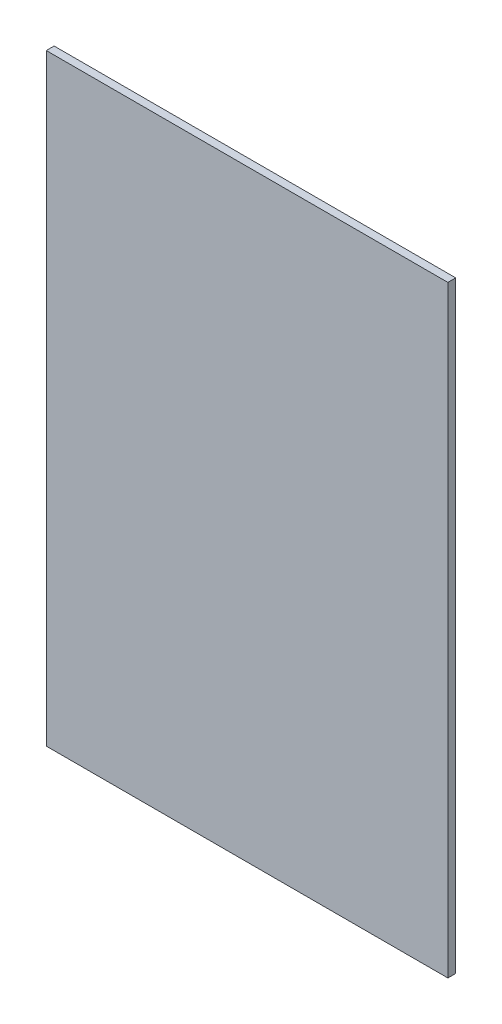
ISO-10303-21;
HEADER;
FILE_DESCRIPTION(('STEP AP214'),'2;1');
FILE_NAME('part.step','',(''),(''),'','','');
FILE_SCHEMA(('AUTOMOTIVE_DESIGN { 1 0 10303 214 1 1 1 1 }'));
ENDSEC;
DATA;
#1=APPLICATION_CONTEXT('core data for automotive mechanical design processes');
#2=APPLICATION_PROTOCOL_DEFINITION('international standard','automotive_design',2000,#1);
#3=PRODUCT_CONTEXT('',#1,'mechanical');
#4=PRODUCT('Part','Part','',(#3));
#5=PRODUCT_RELATED_PRODUCT_CATEGORY('part','',(#4));
#6=PRODUCT_DEFINITION_FORMATION('','',#4);
#7=PRODUCT_DEFINITION_CONTEXT('part definition',#1,'design');
#8=PRODUCT_DEFINITION('design','',#6,#7);
#9=PRODUCT_DEFINITION_SHAPE('','',#8);
#10=(LENGTH_UNIT() NAMED_UNIT(*) SI_UNIT(.MILLI.,.METRE.));
#11=(NAMED_UNIT(*) PLANE_ANGLE_UNIT() SI_UNIT($,.RADIAN.));
#12=(NAMED_UNIT(*) SI_UNIT($,.STERADIAN.) SOLID_ANGLE_UNIT());
#13=UNCERTAINTY_MEASURE_WITH_UNIT(LENGTH_MEASURE(1.E-05),#10,'distance_accuracy_value','');
#14=(GEOMETRIC_REPRESENTATION_CONTEXT(3) GLOBAL_UNCERTAINTY_ASSIGNED_CONTEXT((#13)) GLOBAL_UNIT_ASSIGNED_CONTEXT((#10,
#11,#12)) REPRESENTATION_CONTEXT('',''));
#15=CARTESIAN_POINT('',(0.,0.,0.));
#16=DIRECTION('',(0.,0.,1.));
#17=DIRECTION('',(1.,0.,0.));
#18=AXIS2_PLACEMENT_3D('',#15,#16,#17);
#19=CARTESIAN_POINT('',(304.8,-457.2,11.90625));
#20=DIRECTION('',(-1.,0.,0.));
#21=DIRECTION('',(0.,0.,1.));
#22=AXIS2_PLACEMENT_3D('',#19,#20,#21);
#23=PLANE('',#22);
#24=DIRECTION('',(0.,1.,0.));
#25=VECTOR('',#24,1.);
#26=CARTESIAN_POINT('',(304.8,-457.2,0.));
#27=LINE('',#26,#25);
#28=CARTESIAN_POINT('',(304.8,-457.2,0.));
#29=VERTEX_POINT('',#28);
#30=CARTESIAN_POINT('',(304.8,457.2,0.));
#31=VERTEX_POINT('',#30);
#32=EDGE_CURVE('E107',#29,#31,#27,.T.);
#33=ORIENTED_EDGE('',*,*,#32,.T.);
#34=DIRECTION('',(0.,0.,-1.));
#35=VECTOR('',#34,1.);
#36=CARTESIAN_POINT('',(304.8,457.2,11.90625));
#37=LINE('',#36,#35);
#38=CARTESIAN_POINT('',(304.8,457.2,11.90625));
#39=VERTEX_POINT('',#38);
#40=EDGE_CURVE('E11',#39,#31,#37,.T.);
#41=ORIENTED_EDGE('',*,*,#40,.F.);
#42=DIRECTION('',(0.,1.,0.));
#43=VECTOR('',#42,1.);
#44=CARTESIAN_POINT('',(304.8,-457.2,11.90625));
#45=LINE('',#44,#43);
#46=CARTESIAN_POINT('',(304.8,-457.2,11.90625));
#47=VERTEX_POINT('',#46);
#48=EDGE_CURVE('E91',#47,#39,#45,.T.);
#49=ORIENTED_EDGE('',*,*,#48,.F.);
#50=DIRECTION('',(0.,0.,-1.));
#51=VECTOR('',#50,1.);
#52=CARTESIAN_POINT('',(304.8,-457.2,11.90625));
#53=LINE('',#52,#51);
#54=EDGE_CURVE('E103',#47,#29,#53,.T.);
#55=ORIENTED_EDGE('',*,*,#54,.T.);
#56=EDGE_LOOP('',(#33,#41,#49,#55));
#57=FACE_BOUND('',#56,.T.);
#58=ADVANCED_FACE('F39',(#57),#23,.F.);
#59=CARTESIAN_POINT('',(-304.8,457.2,11.90625));
#60=DIRECTION('',(0.,-1.,0.));
#61=DIRECTION('',(0.,0.,-1.));
#62=AXIS2_PLACEMENT_3D('',#59,#60,#61);
#63=PLANE('',#62);
#64=DIRECTION('',(-1.,0.,0.));
#65=VECTOR('',#64,1.);
#66=CARTESIAN_POINT('',(-304.8,457.2,0.));
#67=LINE('',#66,#65);
#68=CARTESIAN_POINT('',(-304.8,457.2,0.));
#69=VERTEX_POINT('',#68);
#70=EDGE_CURVE('E96',#31,#69,#67,.T.);
#71=ORIENTED_EDGE('',*,*,#70,.T.);
#72=DIRECTION('',(0.,0.,-1.));
#73=VECTOR('',#72,1.);
#74=CARTESIAN_POINT('',(-304.8,457.2,11.90625));
#75=LINE('',#74,#73);
#76=CARTESIAN_POINT('',(-304.8,457.2,11.90625));
#77=VERTEX_POINT('',#76);
#78=EDGE_CURVE('E48',#77,#69,#75,.T.);
#79=ORIENTED_EDGE('',*,*,#78,.F.);
#80=DIRECTION('',(-1.,0.,0.));
#81=VECTOR('',#80,1.);
#82=CARTESIAN_POINT('',(-304.8,457.2,11.90625));
#83=LINE('',#82,#81);
#84=EDGE_CURVE('E86',#39,#77,#83,.T.);
#85=ORIENTED_EDGE('',*,*,#84,.F.);
#86=ORIENTED_EDGE('',*,*,#40,.T.);
#87=EDGE_LOOP('',(#71,#79,#85,#86));
#88=FACE_BOUND('',#87,.T.);
#89=ADVANCED_FACE('F95',(#88),#63,.F.);
#90=CARTESIAN_POINT('',(-304.8,-457.2,11.90625));
#91=DIRECTION('',(1.,0.,0.));
#92=DIRECTION('',(0.,0.,-1.));
#93=AXIS2_PLACEMENT_3D('',#90,#91,#92);
#94=PLANE('',#93);
#95=DIRECTION('',(0.,-1.,0.));
#96=VECTOR('',#95,1.);
#97=CARTESIAN_POINT('',(-304.8,-457.2,0.));
#98=LINE('',#97,#96);
#99=CARTESIAN_POINT('',(-304.8,-457.2,0.));
#100=VERTEX_POINT('',#99);
#101=EDGE_CURVE('E73',#69,#100,#98,.T.);
#102=ORIENTED_EDGE('',*,*,#101,.T.);
#103=DIRECTION('',(0.,0.,-1.));
#104=VECTOR('',#103,1.);
#105=CARTESIAN_POINT('',(-304.8,-457.2,11.90625));
#106=LINE('',#105,#104);
#107=CARTESIAN_POINT('',(-304.8,-457.2,11.90625));
#108=VERTEX_POINT('',#107);
#109=EDGE_CURVE('E98',#108,#100,#106,.T.);
#110=ORIENTED_EDGE('',*,*,#109,.F.);
#111=DIRECTION('',(0.,-1.,0.));
#112=VECTOR('',#111,1.);
#113=CARTESIAN_POINT('',(-304.8,-457.2,11.90625));
#114=LINE('',#113,#112);
#115=EDGE_CURVE('E89',#77,#108,#114,.T.);
#116=ORIENTED_EDGE('',*,*,#115,.F.);
#117=ORIENTED_EDGE('',*,*,#78,.T.);
#118=EDGE_LOOP('',(#102,#110,#116,#117));
#119=FACE_BOUND('',#118,.T.);
#120=ADVANCED_FACE('F99',(#119),#94,.F.);
#121=CARTESIAN_POINT('',(-304.8,-457.2,11.90625));
#122=DIRECTION('',(0.,1.,0.));
#123=DIRECTION('',(0.,0.,1.));
#124=AXIS2_PLACEMENT_3D('',#121,#122,#123);
#125=PLANE('',#124);
#126=DIRECTION('',(1.,0.,0.));
#127=VECTOR('',#126,1.);
#128=CARTESIAN_POINT('',(-304.8,-457.2,0.));
#129=LINE('',#128,#127);
#130=EDGE_CURVE('E79',#100,#29,#129,.T.);
#131=ORIENTED_EDGE('',*,*,#130,.T.);
#132=ORIENTED_EDGE('',*,*,#54,.F.);
#133=DIRECTION('',(1.,0.,0.));
#134=VECTOR('',#133,1.);
#135=CARTESIAN_POINT('',(-304.8,-457.2,11.90625));
#136=LINE('',#135,#134);
#137=EDGE_CURVE('E56',#108,#47,#136,.T.);
#138=ORIENTED_EDGE('',*,*,#137,.F.);
#139=ORIENTED_EDGE('',*,*,#109,.T.);
#140=EDGE_LOOP('',(#131,#132,#138,#139));
#141=FACE_BOUND('',#140,.T.);
#142=ADVANCED_FACE('F120',(#141),#125,.F.);
#143=CARTESIAN_POINT('',(0.,0.,11.90625));
#144=DIRECTION('',(0.,0.,-1.));
#145=DIRECTION('',(-1.,0.,0.));
#146=AXIS2_PLACEMENT_3D('',#143,#144,#145);
#147=PLANE('',#146);
#148=ORIENTED_EDGE('',*,*,#48,.T.);
#149=ORIENTED_EDGE('',*,*,#84,.T.);
#150=ORIENTED_EDGE('',*,*,#115,.T.);
#151=ORIENTED_EDGE('',*,*,#137,.T.);
#152=EDGE_LOOP('',(#148,#149,#150,#151));
#153=FACE_BOUND('',#152,.T.);
#154=ADVANCED_FACE('F87',(#153),#147,.F.);
#155=CARTESIAN_POINT('',(0.,0.,0.));
#156=DIRECTION('',(0.,0.,-1.));
#157=DIRECTION('',(-1.,0.,0.));
#158=AXIS2_PLACEMENT_3D('',#155,#156,#157);
#159=PLANE('',#158);
#160=ORIENTED_EDGE('',*,*,#32,.F.);
#161=ORIENTED_EDGE('',*,*,#130,.F.);
#162=ORIENTED_EDGE('',*,*,#101,.F.);
#163=ORIENTED_EDGE('',*,*,#70,.F.);
#164=EDGE_LOOP('',(#160,#161,#162,#163));
#165=FACE_BOUND('',#164,.T.);
#166=ADVANCED_FACE('F123',(#165),#159,.T.);
#167=CLOSED_SHELL('',(#58,#89,#120,#142,#154,#166));
#168=MANIFOLD_SOLID_BREP('B2',#167);
#169=ADVANCED_BREP_SHAPE_REPRESENTATION('',(#18,#168),#14);
#170=SHAPE_DEFINITION_REPRESENTATION(#9,#169);
ENDSEC;
END-ISO-10303-21;
